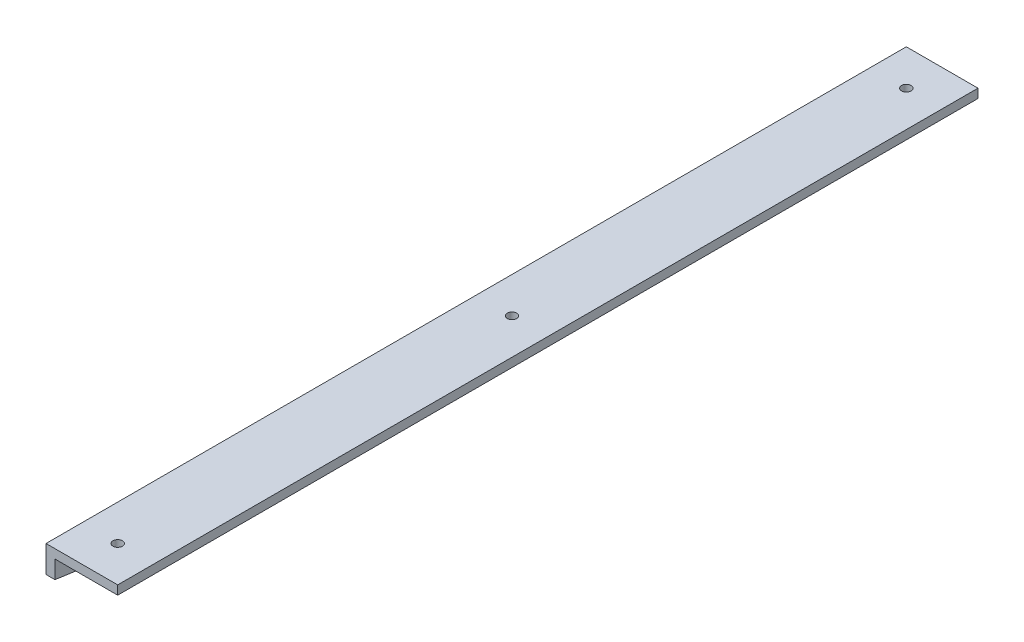
ISO-10303-21;
HEADER;
FILE_DESCRIPTION(('STEP AP214'),'2;1');
FILE_NAME('part.step','',(''),(''),'','','');
FILE_SCHEMA(('AUTOMOTIVE_DESIGN { 1 0 10303 214 1 1 1 1 }'));
ENDSEC;
DATA;
#1=APPLICATION_CONTEXT('core data for automotive mechanical design processes');
#2=APPLICATION_PROTOCOL_DEFINITION('international standard','automotive_design',2000,#1);
#3=PRODUCT_CONTEXT('',#1,'mechanical');
#4=PRODUCT('Part','Part','',(#3));
#5=PRODUCT_RELATED_PRODUCT_CATEGORY('part','',(#4));
#6=PRODUCT_DEFINITION_FORMATION('','',#4);
#7=PRODUCT_DEFINITION_CONTEXT('part definition',#1,'design');
#8=PRODUCT_DEFINITION('design','',#6,#7);
#9=PRODUCT_DEFINITION_SHAPE('','',#8);
#10=(LENGTH_UNIT() NAMED_UNIT(*) SI_UNIT(.MILLI.,.METRE.));
#11=(NAMED_UNIT(*) PLANE_ANGLE_UNIT() SI_UNIT($,.RADIAN.));
#12=(NAMED_UNIT(*) SI_UNIT($,.STERADIAN.) SOLID_ANGLE_UNIT());
#13=UNCERTAINTY_MEASURE_WITH_UNIT(LENGTH_MEASURE(1.E-05),#10,'distance_accuracy_value','');
#14=(GEOMETRIC_REPRESENTATION_CONTEXT(3) GLOBAL_UNCERTAINTY_ASSIGNED_CONTEXT((#13)) GLOBAL_UNIT_ASSIGNED_CONTEXT((#10,
#11,#12)) REPRESENTATION_CONTEXT('',''));
#15=CARTESIAN_POINT('',(0.,0.,0.));
#16=DIRECTION('',(0.,0.,1.));
#17=DIRECTION('',(1.,0.,0.));
#18=AXIS2_PLACEMENT_3D('',#15,#16,#17);
#19=CARTESIAN_POINT('',(0.,-25.4,304.8));
#20=DIRECTION('',(-1.,0.,0.));
#21=DIRECTION('',(0.,0.,1.));
#22=AXIS2_PLACEMENT_3D('',#19,#20,#21);
#23=CYLINDRICAL_SURFACE('',#22,3.3655);
#24=CARTESIAN_POINT('',(0.,-25.4,304.8));
#25=DIRECTION('',(-1.,0.,0.));
#26=DIRECTION('',(0.,0.,1.));
#27=AXIS2_PLACEMENT_3D('',#24,#25,#26);
#28=CIRCLE('',#27,3.3655);
#29=CARTESIAN_POINT('',(0.,-25.4,308.1655));
#30=VERTEX_POINT('',#29);
#31=EDGE_CURVE('E127',#30,#30,#28,.F.);
#32=ORIENTED_EDGE('',*,*,#31,.F.);
#33=EDGE_LOOP('',(#32));
#34=FACE_BOUND('',#33,.T.);
#35=CARTESIAN_POINT('',(6.35,-25.4,304.8));
#36=DIRECTION('',(-1.,0.,0.));
#37=DIRECTION('',(0.,0.,1.));
#38=AXIS2_PLACEMENT_3D('',#35,#36,#37);
#39=CIRCLE('',#38,3.3655);
#40=CARTESIAN_POINT('',(6.35,-25.4,308.1655));
#41=VERTEX_POINT('',#40);
#42=EDGE_CURVE('E20',#41,#41,#39,.T.);
#43=ORIENTED_EDGE('',*,*,#42,.F.);
#44=EDGE_LOOP('',(#43));
#45=FACE_BOUND('',#44,.T.);
#46=ADVANCED_FACE('F17',(#34,#45),#23,.F.);
#47=CARTESIAN_POINT('',(0.,-15.875,558.8));
#48=DIRECTION('',(-1.,0.,0.));
#49=DIRECTION('',(0.,0.,1.));
#50=AXIS2_PLACEMENT_3D('',#47,#48,#49);
#51=CYLINDRICAL_SURFACE('',#50,3.3655);
#52=CARTESIAN_POINT('',(0.,-15.875,558.8));
#53=DIRECTION('',(-1.,0.,0.));
#54=DIRECTION('',(0.,0.,1.));
#55=AXIS2_PLACEMENT_3D('',#52,#53,#54);
#56=CIRCLE('',#55,3.3655);
#57=CARTESIAN_POINT('',(0.,-15.875,562.1655));
#58=VERTEX_POINT('',#57);
#59=EDGE_CURVE('E124',#58,#58,#56,.F.);
#60=ORIENTED_EDGE('',*,*,#59,.F.);
#61=EDGE_LOOP('',(#60));
#62=FACE_BOUND('',#61,.T.);
#63=CARTESIAN_POINT('',(6.35,-15.875,558.8));
#64=DIRECTION('',(-1.,0.,0.));
#65=DIRECTION('',(0.,0.,1.));
#66=AXIS2_PLACEMENT_3D('',#63,#64,#65);
#67=CIRCLE('',#66,3.3655);
#68=CARTESIAN_POINT('',(6.35,-15.875,562.1655));
#69=VERTEX_POINT('',#68);
#70=EDGE_CURVE('E99',#69,#69,#67,.T.);
#71=ORIENTED_EDGE('',*,*,#70,.F.);
#72=EDGE_LOOP('',(#71));
#73=FACE_BOUND('',#72,.T.);
#74=ADVANCED_FACE('F137',(#62,#73),#51,.F.);
#75=CARTESIAN_POINT('',(0.,-25.4,50.8));
#76=DIRECTION('',(-1.,0.,0.));
#77=DIRECTION('',(0.,0.,1.));
#78=AXIS2_PLACEMENT_3D('',#75,#76,#77);
#79=CYLINDRICAL_SURFACE('',#78,3.3655);
#80=CARTESIAN_POINT('',(0.,-25.4,50.8));
#81=DIRECTION('',(-1.,0.,0.));
#82=DIRECTION('',(0.,0.,1.));
#83=AXIS2_PLACEMENT_3D('',#80,#81,#82);
#84=CIRCLE('',#83,3.3655);
#85=CARTESIAN_POINT('',(0.,-25.4,54.1655));
#86=VERTEX_POINT('',#85);
#87=EDGE_CURVE('E121',#86,#86,#84,.F.);
#88=ORIENTED_EDGE('',*,*,#87,.F.);
#89=EDGE_LOOP('',(#88));
#90=FACE_BOUND('',#89,.T.);
#91=CARTESIAN_POINT('',(6.35,-25.4,50.8));
#92=DIRECTION('',(-1.,0.,0.));
#93=DIRECTION('',(0.,0.,1.));
#94=AXIS2_PLACEMENT_3D('',#91,#92,#93);
#95=CIRCLE('',#94,3.3655);
#96=CARTESIAN_POINT('',(6.35,-25.4,54.1655));
#97=VERTEX_POINT('',#96);
#98=EDGE_CURVE('E130',#97,#97,#95,.T.);
#99=ORIENTED_EDGE('',*,*,#98,.F.);
#100=EDGE_LOOP('',(#99));
#101=FACE_BOUND('',#100,.T.);
#102=ADVANCED_FACE('F139',(#90,#101),#79,.F.);
#103=CARTESIAN_POINT('',(3.175,-34.925,496.8875));
#104=DIRECTION('',(0.,-0.990226505105836,0.139468521845905));
#105=DIRECTION('',(0.,-0.139468521845905,-0.990226505105836));
#106=AXIS2_PLACEMENT_3D('',#103,#104,#105);
#107=PLANE('',#106);
#108=DIRECTION('',(1.,0.,0.));
#109=VECTOR('',#108,1.);
#110=CARTESIAN_POINT('',(0.,-50.8,384.175));
#111=LINE('',#110,#109);
#112=CARTESIAN_POINT('',(6.35,-50.8000000000004,384.175));
#113=VERTEX_POINT('',#112);
#114=CARTESIAN_POINT('',(0.,-50.8000000000004,384.174999999999));
#115=VERTEX_POINT('',#114);
#116=EDGE_CURVE('E74',#113,#115,#111,.F.);
#117=ORIENTED_EDGE('',*,*,#116,.F.);
#118=DIRECTION('',(0.,-0.139468521845893,-0.990226505105838));
#119=VECTOR('',#118,1.);
#120=CARTESIAN_POINT('',(6.35,-19.05,609.6));
#121=LINE('',#120,#119);
#122=CARTESIAN_POINT('',(6.35,-19.0499999999996,609.6));
#123=VERTEX_POINT('',#122);
#124=EDGE_CURVE('E80',#123,#113,#121,.T.);
#125=ORIENTED_EDGE('',*,*,#124,.F.);
#126=DIRECTION('',(1.,0.,0.));
#127=VECTOR('',#126,1.);
#128=CARTESIAN_POINT('',(0.,-19.05,609.6));
#129=LINE('',#128,#127);
#130=CARTESIAN_POINT('',(0.,-19.0499999999996,609.6));
#131=VERTEX_POINT('',#130);
#132=EDGE_CURVE('E315',#131,#123,#129,.T.);
#133=ORIENTED_EDGE('',*,*,#132,.F.);
#134=DIRECTION('',(0.,0.139468521845893,0.990226505105838));
#135=VECTOR('',#134,1.);
#136=CARTESIAN_POINT('',(0.,-50.8,384.175));
#137=LINE('',#136,#135);
#138=EDGE_CURVE('E82',#115,#131,#137,.T.);
#139=ORIENTED_EDGE('',*,*,#138,.F.);
#140=EDGE_LOOP('',(#117,#125,#133,#139));
#141=FACE_BOUND('',#140,.T.);
#142=ADVANCED_FACE('F77',(#141),#107,.T.);
#143=CARTESIAN_POINT('',(0.,-50.8,0.));
#144=DIRECTION('',(0.,-1.,0.));
#145=DIRECTION('',(0.,0.,-1.));
#146=AXIS2_PLACEMENT_3D('',#143,#144,#145);
#147=PLANE('',#146);
#148=DIRECTION('',(0.,0.,-1.));
#149=VECTOR('',#148,1.);
#150=CARTESIAN_POINT('',(6.35,-50.8,0.));
#151=LINE('',#150,#149);
#152=CARTESIAN_POINT('',(6.35,-50.8,0.));
#153=VERTEX_POINT('',#152);
#154=EDGE_CURVE('E84',#113,#153,#151,.T.);
#155=ORIENTED_EDGE('',*,*,#154,.F.);
#156=ORIENTED_EDGE('',*,*,#116,.T.);
#157=DIRECTION('',(0.,0.,1.));
#158=VECTOR('',#157,1.);
#159=CARTESIAN_POINT('',(0.,-50.8,0.));
#160=LINE('',#159,#158);
#161=CARTESIAN_POINT('',(0.,-50.8,0.));
#162=VERTEX_POINT('',#161);
#163=EDGE_CURVE('E302',#162,#115,#160,.T.);
#164=ORIENTED_EDGE('',*,*,#163,.F.);
#165=DIRECTION('',(1.,0.,0.));
#166=VECTOR('',#165,1.);
#167=CARTESIAN_POINT('',(0.,-50.8,0.));
#168=LINE('',#167,#166);
#169=EDGE_CURVE('E89',#162,#153,#168,.T.);
#170=ORIENTED_EDGE('',*,*,#169,.T.);
#171=EDGE_LOOP('',(#155,#156,#164,#170));
#172=FACE_BOUND('',#171,.T.);
#173=ADVANCED_FACE('F87',(#172),#147,.T.);
#174=CARTESIAN_POINT('',(6.35,-50.8,0.));
#175=DIRECTION('',(1.,0.,0.));
#176=DIRECTION('',(0.,0.,-1.));
#177=AXIS2_PLACEMENT_3D('',#174,#175,#176);
#178=PLANE('',#177);
#179=ORIENTED_EDGE('',*,*,#98,.T.);
#180=EDGE_LOOP('',(#179));
#181=FACE_BOUND('',#180,.T.);
#182=ORIENTED_EDGE('',*,*,#70,.T.);
#183=EDGE_LOOP('',(#182));
#184=FACE_BOUND('',#183,.T.);
#185=ORIENTED_EDGE('',*,*,#42,.T.);
#186=EDGE_LOOP('',(#185));
#187=FACE_BOUND('',#186,.T.);
#188=DIRECTION('',(0.,1.,0.));
#189=VECTOR('',#188,1.);
#190=CARTESIAN_POINT('',(6.35,0.,609.6));
#191=LINE('',#190,#189);
#192=CARTESIAN_POINT('',(6.35,-6.35,609.6));
#193=VERTEX_POINT('',#192);
#194=EDGE_CURVE('E95',#123,#193,#191,.T.);
#195=ORIENTED_EDGE('',*,*,#194,.F.);
#196=ORIENTED_EDGE('',*,*,#124,.T.);
#197=ORIENTED_EDGE('',*,*,#154,.T.);
#198=DIRECTION('',(0.,1.,0.));
#199=VECTOR('',#198,1.);
#200=CARTESIAN_POINT('',(6.35,0.,0.));
#201=LINE('',#200,#199);
#202=CARTESIAN_POINT('',(6.35,-6.35,0.));
#203=VERTEX_POINT('',#202);
#204=EDGE_CURVE('E303',#153,#203,#201,.T.);
#205=ORIENTED_EDGE('',*,*,#204,.T.);
#206=DIRECTION('',(0.,0.,-1.));
#207=VECTOR('',#206,1.);
#208=CARTESIAN_POINT('',(6.35,-6.35,0.));
#209=LINE('',#208,#207);
#210=EDGE_CURVE('E101',#193,#203,#209,.T.);
#211=ORIENTED_EDGE('',*,*,#210,.F.);
#212=EDGE_LOOP('',(#195,#196,#197,#205,#211));
#213=FACE_BOUND('',#212,.T.);
#214=ADVANCED_FACE('F93',(#181,#184,#187,#213),#178,.T.);
#215=CARTESIAN_POINT('',(6.35,-6.35,0.));
#216=DIRECTION('',(0.,-1.,0.));
#217=DIRECTION('',(0.,0.,-1.));
#218=AXIS2_PLACEMENT_3D('',#215,#216,#217);
#219=PLANE('',#218);
#220=CARTESIAN_POINT('',(25.4,-6.35,584.2));
#221=DIRECTION('',(0.,1.,0.));
#222=DIRECTION('',(0.,0.,1.));
#223=AXIS2_PLACEMENT_3D('',#220,#221,#222);
#224=CIRCLE('',#223,3.3655);
#225=CARTESIAN_POINT('',(25.4,-6.35,587.5655));
#226=VERTEX_POINT('',#225);
#227=EDGE_CURVE('E110',#226,#226,#224,.T.);
#228=ORIENTED_EDGE('',*,*,#227,.T.);
#229=EDGE_LOOP('',(#228));
#230=FACE_BOUND('',#229,.T.);
#231=CARTESIAN_POINT('',(25.4,-6.35,304.8));
#232=DIRECTION('',(0.,1.,0.));
#233=DIRECTION('',(0.,0.,1.));
#234=AXIS2_PLACEMENT_3D('',#231,#232,#233);
#235=CIRCLE('',#234,3.3655);
#236=CARTESIAN_POINT('',(25.4,-6.35,308.1655));
#237=VERTEX_POINT('',#236);
#238=EDGE_CURVE('E114',#237,#237,#235,.T.);
#239=ORIENTED_EDGE('',*,*,#238,.T.);
#240=EDGE_LOOP('',(#239));
#241=FACE_BOUND('',#240,.T.);
#242=CARTESIAN_POINT('',(25.4,-6.35,25.4));
#243=DIRECTION('',(0.,1.,0.));
#244=DIRECTION('',(0.,0.,1.));
#245=AXIS2_PLACEMENT_3D('',#242,#243,#244);
#246=CIRCLE('',#245,3.3655);
#247=CARTESIAN_POINT('',(25.4,-6.35,28.7655));
#248=VERTEX_POINT('',#247);
#249=EDGE_CURVE('E117',#248,#248,#246,.T.);
#250=ORIENTED_EDGE('',*,*,#249,.T.);
#251=EDGE_LOOP('',(#250));
#252=FACE_BOUND('',#251,.T.);
#253=ORIENTED_EDGE('',*,*,#210,.T.);
#254=DIRECTION('',(1.,0.,0.));
#255=VECTOR('',#254,1.);
#256=CARTESIAN_POINT('',(0.,-6.35,0.));
#257=LINE('',#256,#255);
#258=CARTESIAN_POINT('',(50.8,-6.35,0.));
#259=VERTEX_POINT('',#258);
#260=EDGE_CURVE('E300',#203,#259,#257,.T.);
#261=ORIENTED_EDGE('',*,*,#260,.T.);
#262=DIRECTION('',(0.,0.,-1.));
#263=VECTOR('',#262,1.);
#264=CARTESIAN_POINT('',(50.8,-6.35,0.));
#265=LINE('',#264,#263);
#266=CARTESIAN_POINT('',(50.8,-6.35,609.6));
#267=VERTEX_POINT('',#266);
#268=EDGE_CURVE('E310',#267,#259,#265,.T.);
#269=ORIENTED_EDGE('',*,*,#268,.F.);
#270=DIRECTION('',(1.,0.,0.));
#271=VECTOR('',#270,1.);
#272=CARTESIAN_POINT('',(0.,-6.35,609.6));
#273=LINE('',#272,#271);
#274=EDGE_CURVE('E301',#193,#267,#273,.T.);
#275=ORIENTED_EDGE('',*,*,#274,.F.);
#276=EDGE_LOOP('',(#253,#261,#269,#275));
#277=FACE_BOUND('',#276,.T.);
#278=ADVANCED_FACE('F184',(#230,#241,#252,#277),#219,.T.);
#279=CARTESIAN_POINT('',(0.,0.,0.));
#280=DIRECTION('',(-1.,0.,0.));
#281=DIRECTION('',(0.,0.,1.));
#282=AXIS2_PLACEMENT_3D('',#279,#280,#281);
#283=PLANE('',#282);
#284=ORIENTED_EDGE('',*,*,#87,.T.);
#285=EDGE_LOOP('',(#284));
#286=FACE_BOUND('',#285,.T.);
#287=ORIENTED_EDGE('',*,*,#59,.T.);
#288=EDGE_LOOP('',(#287));
#289=FACE_BOUND('',#288,.T.);
#290=ORIENTED_EDGE('',*,*,#31,.T.);
#291=EDGE_LOOP('',(#290));
#292=FACE_BOUND('',#291,.T.);
#293=ORIENTED_EDGE('',*,*,#163,.T.);
#294=ORIENTED_EDGE('',*,*,#138,.T.);
#295=DIRECTION('',(0.,1.,0.));
#296=VECTOR('',#295,1.);
#297=CARTESIAN_POINT('',(0.,0.,609.6));
#298=LINE('',#297,#296);
#299=CARTESIAN_POINT('',(0.,0.,609.6));
#300=VERTEX_POINT('',#299);
#301=EDGE_CURVE('E317',#300,#131,#298,.F.);
#302=ORIENTED_EDGE('',*,*,#301,.F.);
#303=DIRECTION('',(0.,0.,1.));
#304=VECTOR('',#303,1.);
#305=CARTESIAN_POINT('',(0.,0.,0.));
#306=LINE('',#305,#304);
#307=CARTESIAN_POINT('',(0.,0.,0.));
#308=VERTEX_POINT('',#307);
#309=EDGE_CURVE('E113',#308,#300,#306,.T.);
#310=ORIENTED_EDGE('',*,*,#309,.F.);
#311=DIRECTION('',(0.,1.,0.));
#312=VECTOR('',#311,1.);
#313=CARTESIAN_POINT('',(0.,0.,0.));
#314=LINE('',#313,#312);
#315=EDGE_CURVE('E120',#308,#162,#314,.F.);
#316=ORIENTED_EDGE('',*,*,#315,.T.);
#317=EDGE_LOOP('',(#293,#294,#302,#310,#316));
#318=FACE_BOUND('',#317,.T.);
#319=ADVANCED_FACE('F180',(#286,#289,#292,#318),#283,.T.);
#320=CARTESIAN_POINT('',(0.,0.,609.6));
#321=DIRECTION('',(0.,0.,1.));
#322=DIRECTION('',(1.,0.,0.));
#323=AXIS2_PLACEMENT_3D('',#320,#321,#322);
#324=PLANE('',#323);
#325=ORIENTED_EDGE('',*,*,#301,.T.);
#326=ORIENTED_EDGE('',*,*,#132,.T.);
#327=ORIENTED_EDGE('',*,*,#194,.T.);
#328=ORIENTED_EDGE('',*,*,#274,.T.);
#329=DIRECTION('',(0.,1.,0.));
#330=VECTOR('',#329,1.);
#331=CARTESIAN_POINT('',(50.8,-6.35,609.6));
#332=LINE('',#331,#330);
#333=CARTESIAN_POINT('',(50.8,0.,609.6));
#334=VERTEX_POINT('',#333);
#335=EDGE_CURVE('E312',#334,#267,#332,.F.);
#336=ORIENTED_EDGE('',*,*,#335,.F.);
#337=DIRECTION('',(1.,0.,0.));
#338=VECTOR('',#337,1.);
#339=CARTESIAN_POINT('',(50.8,0.,609.6));
#340=LINE('',#339,#338);
#341=EDGE_CURVE('E329',#300,#334,#340,.T.);
#342=ORIENTED_EDGE('',*,*,#341,.F.);
#343=EDGE_LOOP('',(#325,#326,#327,#328,#336,#342));
#344=FACE_BOUND('',#343,.T.);
#345=ADVANCED_FACE('F177',(#344),#324,.T.);
#346=CARTESIAN_POINT('',(50.8,-6.35,0.));
#347=DIRECTION('',(1.,0.,0.));
#348=DIRECTION('',(0.,0.,-1.));
#349=AXIS2_PLACEMENT_3D('',#346,#347,#348);
#350=PLANE('',#349);
#351=ORIENTED_EDGE('',*,*,#268,.T.);
#352=DIRECTION('',(0.,1.,0.));
#353=VECTOR('',#352,1.);
#354=CARTESIAN_POINT('',(50.8,0.,0.));
#355=LINE('',#354,#353);
#356=CARTESIAN_POINT('',(50.8,0.,0.));
#357=VERTEX_POINT('',#356);
#358=EDGE_CURVE('E35',#259,#357,#355,.T.);
#359=ORIENTED_EDGE('',*,*,#358,.T.);
#360=DIRECTION('',(0.,0.,1.));
#361=VECTOR('',#360,1.);
#362=CARTESIAN_POINT('',(50.8,0.,0.));
#363=LINE('',#362,#361);
#364=EDGE_CURVE('E332',#334,#357,#363,.F.);
#365=ORIENTED_EDGE('',*,*,#364,.F.);
#366=ORIENTED_EDGE('',*,*,#335,.T.);
#367=EDGE_LOOP('',(#351,#359,#365,#366));
#368=FACE_BOUND('',#367,.T.);
#369=ADVANCED_FACE('F173',(#368),#350,.T.);
#370=CARTESIAN_POINT('',(0.,0.,0.));
#371=DIRECTION('',(0.,0.,1.));
#372=DIRECTION('',(1.,0.,0.));
#373=AXIS2_PLACEMENT_3D('',#370,#371,#372);
#374=PLANE('',#373);
#375=DIRECTION('',(1.,0.,0.));
#376=VECTOR('',#375,1.);
#377=CARTESIAN_POINT('',(50.8,0.,0.));
#378=LINE('',#377,#376);
#379=EDGE_CURVE('E109',#357,#308,#378,.F.);
#380=ORIENTED_EDGE('',*,*,#379,.F.);
#381=ORIENTED_EDGE('',*,*,#358,.F.);
#382=ORIENTED_EDGE('',*,*,#260,.F.);
#383=ORIENTED_EDGE('',*,*,#204,.F.);
#384=ORIENTED_EDGE('',*,*,#169,.F.);
#385=ORIENTED_EDGE('',*,*,#315,.F.);
#386=EDGE_LOOP('',(#380,#381,#382,#383,#384,#385));
#387=FACE_BOUND('',#386,.T.);
#388=ADVANCED_FACE('F169',(#387),#374,.F.);
#389=CARTESIAN_POINT('',(25.4,0.,25.4));
#390=DIRECTION('',(0.,1.,0.));
#391=DIRECTION('',(0.,0.,1.));
#392=AXIS2_PLACEMENT_3D('',#389,#390,#391);
#393=CYLINDRICAL_SURFACE('',#392,3.3655);
#394=CARTESIAN_POINT('',(25.4,0.,25.4));
#395=DIRECTION('',(0.,1.,0.));
#396=DIRECTION('',(0.,0.,1.));
#397=AXIS2_PLACEMENT_3D('',#394,#395,#396);
#398=CIRCLE('',#397,3.3655);
#399=CARTESIAN_POINT('',(25.4,0.,28.7655));
#400=VERTEX_POINT('',#399);
#401=EDGE_CURVE('E106',#400,#400,#398,.F.);
#402=ORIENTED_EDGE('',*,*,#401,.F.);
#403=EDGE_LOOP('',(#402));
#404=FACE_BOUND('',#403,.T.);
#405=ORIENTED_EDGE('',*,*,#249,.F.);
#406=EDGE_LOOP('',(#405));
#407=FACE_BOUND('',#406,.T.);
#408=ADVANCED_FACE('F165',(#404,#407),#393,.F.);
#409=CARTESIAN_POINT('',(25.4,0.,304.8));
#410=DIRECTION('',(0.,1.,0.));
#411=DIRECTION('',(0.,0.,1.));
#412=AXIS2_PLACEMENT_3D('',#409,#410,#411);
#413=CYLINDRICAL_SURFACE('',#412,3.3655);
#414=CARTESIAN_POINT('',(25.4,0.,304.8));
#415=DIRECTION('',(0.,1.,0.));
#416=DIRECTION('',(0.,0.,1.));
#417=AXIS2_PLACEMENT_3D('',#414,#415,#416);
#418=CIRCLE('',#417,3.3655);
#419=CARTESIAN_POINT('',(25.4,0.,308.1655));
#420=VERTEX_POINT('',#419);
#421=EDGE_CURVE('E26',#420,#420,#418,.F.);
#422=ORIENTED_EDGE('',*,*,#421,.F.);
#423=EDGE_LOOP('',(#422));
#424=FACE_BOUND('',#423,.T.);
#425=ORIENTED_EDGE('',*,*,#238,.F.);
#426=EDGE_LOOP('',(#425));
#427=FACE_BOUND('',#426,.T.);
#428=ADVANCED_FACE('F158',(#424,#427),#413,.F.);
#429=CARTESIAN_POINT('',(25.4,0.,584.2));
#430=DIRECTION('',(0.,1.,0.));
#431=DIRECTION('',(0.,0.,1.));
#432=AXIS2_PLACEMENT_3D('',#429,#430,#431);
#433=CYLINDRICAL_SURFACE('',#432,3.3655);
#434=CARTESIAN_POINT('',(25.4,0.,584.2));
#435=DIRECTION('',(0.,1.,0.));
#436=DIRECTION('',(0.,0.,1.));
#437=AXIS2_PLACEMENT_3D('',#434,#435,#436);
#438=CIRCLE('',#437,3.3655);
#439=CARTESIAN_POINT('',(25.4,0.,587.5655));
#440=VERTEX_POINT('',#439);
#441=EDGE_CURVE('E11',#440,#440,#438,.F.);
#442=ORIENTED_EDGE('',*,*,#441,.F.);
#443=EDGE_LOOP('',(#442));
#444=FACE_BOUND('',#443,.T.);
#445=ORIENTED_EDGE('',*,*,#227,.F.);
#446=EDGE_LOOP('',(#445));
#447=FACE_BOUND('',#446,.T.);
#448=ADVANCED_FACE('F152',(#444,#447),#433,.F.);
#449=CARTESIAN_POINT('',(50.8,0.,0.));
#450=DIRECTION('',(0.,1.,0.));
#451=DIRECTION('',(0.,0.,1.));
#452=AXIS2_PLACEMENT_3D('',#449,#450,#451);
#453=PLANE('',#452);
#454=ORIENTED_EDGE('',*,*,#441,.T.);
#455=EDGE_LOOP('',(#454));
#456=FACE_BOUND('',#455,.T.);
#457=ORIENTED_EDGE('',*,*,#421,.T.);
#458=EDGE_LOOP('',(#457));
#459=FACE_BOUND('',#458,.T.);
#460=ORIENTED_EDGE('',*,*,#401,.T.);
#461=EDGE_LOOP('',(#460));
#462=FACE_BOUND('',#461,.T.);
#463=ORIENTED_EDGE('',*,*,#364,.T.);
#464=ORIENTED_EDGE('',*,*,#379,.T.);
#465=ORIENTED_EDGE('',*,*,#309,.T.);
#466=ORIENTED_EDGE('',*,*,#341,.T.);
#467=EDGE_LOOP('',(#463,#464,#465,#466));
#468=FACE_BOUND('',#467,.T.);
#469=ADVANCED_FACE('F150',(#456,#459,#462,#468),#453,.T.);
#470=CLOSED_SHELL('',(#46,#74,#102,#142,#173,#214,#278,#319,#345,#369,#388,#408,#428,#448,#469));
#471=MANIFOLD_SOLID_BREP('B1',#470);
#472=ADVANCED_BREP_SHAPE_REPRESENTATION('',(#18,#471),#14);
#473=SHAPE_DEFINITION_REPRESENTATION(#9,#472);
ENDSEC;
END-ISO-10303-21;
